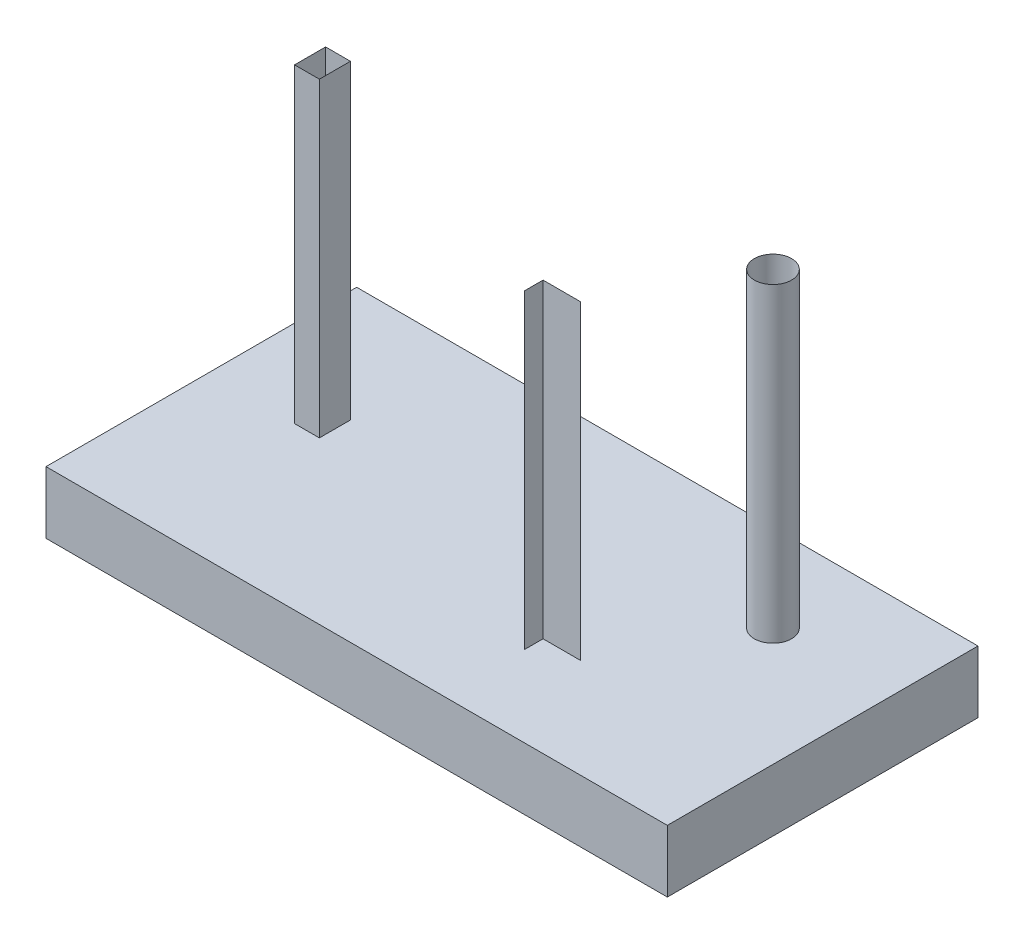
ISO-10303-21;
HEADER;
FILE_DESCRIPTION(('STEP AP214'),'2;1');
FILE_NAME('part.step','',(''),(''),'','','');
FILE_SCHEMA(('AUTOMOTIVE_DESIGN { 1 0 10303 214 1 1 1 1 }'));
ENDSEC;
DATA;
#1=APPLICATION_CONTEXT('core data for automotive mechanical design processes');
#2=APPLICATION_PROTOCOL_DEFINITION('international standard','automotive_design',2000,#1);
#3=PRODUCT_CONTEXT('',#1,'mechanical');
#4=PRODUCT('Part','Part','',(#3));
#5=PRODUCT_RELATED_PRODUCT_CATEGORY('part','',(#4));
#6=PRODUCT_DEFINITION_FORMATION('','',#4);
#7=PRODUCT_DEFINITION_CONTEXT('part definition',#1,'design');
#8=PRODUCT_DEFINITION('design','',#6,#7);
#9=PRODUCT_DEFINITION_SHAPE('','',#8);
#10=(LENGTH_UNIT() NAMED_UNIT(*) SI_UNIT(.MILLI.,.METRE.));
#11=(NAMED_UNIT(*) PLANE_ANGLE_UNIT() SI_UNIT($,.RADIAN.));
#12=(NAMED_UNIT(*) SI_UNIT($,.STERADIAN.) SOLID_ANGLE_UNIT());
#13=UNCERTAINTY_MEASURE_WITH_UNIT(LENGTH_MEASURE(1.E-05),#10,'distance_accuracy_value','');
#14=(GEOMETRIC_REPRESENTATION_CONTEXT(3) GLOBAL_UNCERTAINTY_ASSIGNED_CONTEXT((#13)) GLOBAL_UNIT_ASSIGNED_CONTEXT((#10,
#11,#12)) REPRESENTATION_CONTEXT('',''));
#15=CARTESIAN_POINT('',(0.,0.,0.));
#16=DIRECTION('',(0.,0.,1.));
#17=DIRECTION('',(1.,0.,0.));
#18=AXIS2_PLACEMENT_3D('',#15,#16,#17);
#19=CARTESIAN_POINT('',(71.,11.,-15.));
#20=DIRECTION('',(0.,0.,-1.));
#21=DIRECTION('',(-1.,0.,0.));
#22=AXIS2_PLACEMENT_3D('',#19,#20,#21);
#23=PLANE('',#22);
#24=DIRECTION('',(-1.,0.,0.));
#25=VECTOR('',#24,1.);
#26=CARTESIAN_POINT('',(71.,61.,-15.));
#27=LINE('',#26,#25);
#28=CARTESIAN_POINT('',(71.,61.,-15.));
#29=VERTEX_POINT('',#28);
#30=CARTESIAN_POINT('',(65.,61.,-15.));
#31=VERTEX_POINT('',#30);
#32=EDGE_CURVE('E94',#29,#31,#27,.T.);
#33=ORIENTED_EDGE('',*,*,#32,.F.);
#34=DIRECTION('',(0.,1.,0.));
#35=VECTOR('',#34,1.);
#36=CARTESIAN_POINT('',(71.,11.,-15.));
#37=LINE('',#36,#35);
#38=CARTESIAN_POINT('',(71.,11.,-15.));
#39=VERTEX_POINT('',#38);
#40=EDGE_CURVE('E63',#39,#29,#37,.T.);
#41=ORIENTED_EDGE('',*,*,#40,.F.);
#42=DIRECTION('',(-1.,0.,0.));
#43=VECTOR('',#42,1.);
#44=CARTESIAN_POINT('',(71.,11.,-15.));
#45=LINE('',#44,#43);
#46=CARTESIAN_POINT('',(65.,11.,-15.));
#47=VERTEX_POINT('',#46);
#48=EDGE_CURVE('E13',#39,#47,#45,.T.);
#49=ORIENTED_EDGE('',*,*,#48,.T.);
#50=DIRECTION('',(0.,1.,0.));
#51=VECTOR('',#50,1.);
#52=CARTESIAN_POINT('',(65.,11.,-15.));
#53=LINE('',#52,#51);
#54=EDGE_CURVE('E87',#47,#31,#53,.T.);
#55=ORIENTED_EDGE('',*,*,#54,.T.);
#56=EDGE_LOOP('',(#33,#41,#49,#55));
#57=FACE_BOUND('',#56,.T.);
#58=ADVANCED_FACE('F61',(#57),#23,.T.);
#59=CARTESIAN_POINT('',(65.,11.,-15.));
#60=DIRECTION('',(-1.,0.,0.));
#61=DIRECTION('',(0.,0.,1.));
#62=AXIS2_PLACEMENT_3D('',#59,#60,#61);
#63=PLANE('',#62);
#64=DIRECTION('',(0.,0.,1.));
#65=VECTOR('',#64,1.);
#66=CARTESIAN_POINT('',(65.,61.,-15.));
#67=LINE('',#66,#65);
#68=CARTESIAN_POINT('',(65.,61.,-12.));
#69=VERTEX_POINT('',#68);
#70=EDGE_CURVE('E111',#31,#69,#67,.T.);
#71=ORIENTED_EDGE('',*,*,#70,.F.);
#72=ORIENTED_EDGE('',*,*,#54,.F.);
#73=DIRECTION('',(0.,0.,1.));
#74=VECTOR('',#73,1.);
#75=CARTESIAN_POINT('',(65.,11.,-15.));
#76=LINE('',#75,#74);
#77=CARTESIAN_POINT('',(65.,11.,-12.));
#78=VERTEX_POINT('',#77);
#79=EDGE_CURVE('E106',#47,#78,#76,.T.);
#80=ORIENTED_EDGE('',*,*,#79,.T.);
#81=DIRECTION('',(0.,1.,0.));
#82=VECTOR('',#81,1.);
#83=CARTESIAN_POINT('',(65.,11.,-12.));
#84=LINE('',#83,#82);
#85=EDGE_CURVE('E74',#78,#69,#84,.T.);
#86=ORIENTED_EDGE('',*,*,#85,.T.);
#87=EDGE_LOOP('',(#71,#72,#80,#86));
#88=FACE_BOUND('',#87,.T.);
#89=ADVANCED_FACE('F122',(#88),#63,.T.);
#90=OPEN_SHELL('',(#58,#89));
#91=SHELL_BASED_SURFACE_MODEL('B2',(#90));
#92=CARTESIAN_POINT('',(19.,11.,-30.));
#93=DIRECTION('',(1.,0.,0.));
#94=DIRECTION('',(0.,0.,-1.));
#95=AXIS2_PLACEMENT_3D('',#92,#93,#94);
#96=PLANE('',#95);
#97=DIRECTION('',(0.,0.,-1.));
#98=VECTOR('',#97,1.);
#99=CARTESIAN_POINT('',(19.,61.,-30.));
#100=LINE('',#99,#98);
#101=CARTESIAN_POINT('',(19.,61.,-25.));
#102=VERTEX_POINT('',#101);
#103=CARTESIAN_POINT('',(19.,61.,-30.));
#104=VERTEX_POINT('',#103);
#105=EDGE_CURVE('E167',#102,#104,#100,.T.);
#106=ORIENTED_EDGE('',*,*,#105,.F.);
#107=DIRECTION('',(0.,1.,0.));
#108=VECTOR('',#107,1.);
#109=CARTESIAN_POINT('',(19.,11.,-25.));
#110=LINE('',#109,#108);
#111=CARTESIAN_POINT('',(19.,11.,-25.));
#112=VERTEX_POINT('',#111);
#113=EDGE_CURVE('E175',#112,#102,#110,.T.);
#114=ORIENTED_EDGE('',*,*,#113,.F.);
#115=DIRECTION('',(0.,0.,-1.));
#116=VECTOR('',#115,1.);
#117=CARTESIAN_POINT('',(19.,11.,-30.));
#118=LINE('',#117,#116);
#119=CARTESIAN_POINT('',(19.,11.,-30.));
#120=VERTEX_POINT('',#119);
#121=EDGE_CURVE('E59',#112,#120,#118,.T.);
#122=ORIENTED_EDGE('',*,*,#121,.T.);
#123=DIRECTION('',(0.,1.,0.));
#124=VECTOR('',#123,1.);
#125=CARTESIAN_POINT('',(19.,11.,-30.));
#126=LINE('',#125,#124);
#127=EDGE_CURVE('E161',#120,#104,#126,.T.);
#128=ORIENTED_EDGE('',*,*,#127,.T.);
#129=EDGE_LOOP('',(#106,#114,#122,#128));
#130=FACE_BOUND('',#129,.T.);
#131=ADVANCED_FACE('F159',(#130),#96,.T.);
#132=CARTESIAN_POINT('',(19.,11.,-30.));
#133=DIRECTION('',(0.,0.,-1.));
#134=DIRECTION('',(-1.,0.,0.));
#135=AXIS2_PLACEMENT_3D('',#132,#133,#134);
#136=PLANE('',#135);
#137=DIRECTION('',(-1.,0.,0.));
#138=VECTOR('',#137,1.);
#139=CARTESIAN_POINT('',(19.,61.,-30.));
#140=LINE('',#139,#138);
#141=CARTESIAN_POINT('',(15.,61.,-30.));
#142=VERTEX_POINT('',#141);
#143=EDGE_CURVE('E212',#104,#142,#140,.T.);
#144=ORIENTED_EDGE('',*,*,#143,.F.);
#145=ORIENTED_EDGE('',*,*,#127,.F.);
#146=DIRECTION('',(-1.,0.,0.));
#147=VECTOR('',#146,1.);
#148=CARTESIAN_POINT('',(19.,11.,-30.));
#149=LINE('',#148,#147);
#150=CARTESIAN_POINT('',(15.,11.,-30.));
#151=VERTEX_POINT('',#150);
#152=EDGE_CURVE('E214',#120,#151,#149,.T.);
#153=ORIENTED_EDGE('',*,*,#152,.T.);
#154=DIRECTION('',(0.,1.,0.));
#155=VECTOR('',#154,1.);
#156=CARTESIAN_POINT('',(15.,11.,-30.));
#157=LINE('',#156,#155);
#158=EDGE_CURVE('E204',#151,#142,#157,.T.);
#159=ORIENTED_EDGE('',*,*,#158,.T.);
#160=EDGE_LOOP('',(#144,#145,#153,#159));
#161=FACE_BOUND('',#160,.T.);
#162=ADVANCED_FACE('F215',(#161),#136,.T.);
#163=CARTESIAN_POINT('',(15.,11.,-30.));
#164=DIRECTION('',(-1.,0.,0.));
#165=DIRECTION('',(0.,0.,1.));
#166=AXIS2_PLACEMENT_3D('',#163,#164,#165);
#167=PLANE('',#166);
#168=DIRECTION('',(0.,0.,1.));
#169=VECTOR('',#168,1.);
#170=CARTESIAN_POINT('',(15.,61.,-30.));
#171=LINE('',#170,#169);
#172=CARTESIAN_POINT('',(15.,61.,-25.));
#173=VERTEX_POINT('',#172);
#174=EDGE_CURVE('E209',#142,#173,#171,.T.);
#175=ORIENTED_EDGE('',*,*,#174,.F.);
#176=ORIENTED_EDGE('',*,*,#158,.F.);
#177=DIRECTION('',(0.,0.,1.));
#178=VECTOR('',#177,1.);
#179=CARTESIAN_POINT('',(15.,11.,-30.));
#180=LINE('',#179,#178);
#181=CARTESIAN_POINT('',(15.,11.,-25.));
#182=VERTEX_POINT('',#181);
#183=EDGE_CURVE('E207',#151,#182,#180,.T.);
#184=ORIENTED_EDGE('',*,*,#183,.T.);
#185=DIRECTION('',(0.,1.,0.));
#186=VECTOR('',#185,1.);
#187=CARTESIAN_POINT('',(15.,11.,-25.));
#188=LINE('',#187,#186);
#189=EDGE_CURVE('E192',#182,#173,#188,.T.);
#190=ORIENTED_EDGE('',*,*,#189,.T.);
#191=EDGE_LOOP('',(#175,#176,#184,#190));
#192=FACE_BOUND('',#191,.T.);
#193=ADVANCED_FACE('F206',(#192),#167,.T.);
#194=CARTESIAN_POINT('',(19.,11.,-25.));
#195=DIRECTION('',(0.,0.,1.));
#196=DIRECTION('',(1.,0.,0.));
#197=AXIS2_PLACEMENT_3D('',#194,#195,#196);
#198=PLANE('',#197);
#199=DIRECTION('',(1.,0.,0.));
#200=VECTOR('',#199,1.);
#201=CARTESIAN_POINT('',(19.,61.,-25.));
#202=LINE('',#201,#200);
#203=EDGE_CURVE('E242',#173,#102,#202,.T.);
#204=ORIENTED_EDGE('',*,*,#203,.F.);
#205=ORIENTED_EDGE('',*,*,#189,.F.);
#206=DIRECTION('',(1.,0.,0.));
#207=VECTOR('',#206,1.);
#208=CARTESIAN_POINT('',(19.,11.,-25.));
#209=LINE('',#208,#207);
#210=EDGE_CURVE('E250',#182,#112,#209,.T.);
#211=ORIENTED_EDGE('',*,*,#210,.T.);
#212=ORIENTED_EDGE('',*,*,#113,.T.);
#213=EDGE_LOOP('',(#204,#205,#211,#212));
#214=FACE_BOUND('',#213,.T.);
#215=ADVANCED_FACE('F256',(#214),#198,.T.);
#216=OPEN_SHELL('',(#131,#162,#193,#215));
#217=SHELL_BASED_SURFACE_MODEL('B7',(#216));
#218=CARTESIAN_POINT('',(82.,11.,-35.));
#219=DIRECTION('',(0.,1.,0.));
#220=DIRECTION('',(0.,0.,1.));
#221=AXIS2_PLACEMENT_3D('',#218,#219,#220);
#222=CYLINDRICAL_SURFACE('',#221,3.00000000000001);
#223=CARTESIAN_POINT('',(82.,11.,-35.));
#224=DIRECTION('',(0.,1.,0.));
#225=DIRECTION('',(0.,0.,1.));
#226=AXIS2_PLACEMENT_3D('',#223,#224,#225);
#227=CIRCLE('',#226,3.00000000000001);
#228=CARTESIAN_POINT('',(82.,11.,-32.));
#229=VERTEX_POINT('',#228);
#230=EDGE_CURVE('E325',#229,#229,#227,.T.);
#231=ORIENTED_EDGE('',*,*,#230,.T.);
#232=EDGE_LOOP('',(#231));
#233=FACE_BOUND('',#232,.T.);
#234=CARTESIAN_POINT('',(82.,61.,-35.));
#235=DIRECTION('',(0.,1.,0.));
#236=DIRECTION('',(0.,0.,1.));
#237=AXIS2_PLACEMENT_3D('',#234,#235,#236);
#238=CIRCLE('',#237,3.00000000000001);
#239=CARTESIAN_POINT('',(82.,61.,-32.));
#240=VERTEX_POINT('',#239);
#241=EDGE_CURVE('E158',#240,#240,#238,.T.);
#242=ORIENTED_EDGE('',*,*,#241,.F.);
#243=EDGE_LOOP('',(#242));
#244=FACE_BOUND('',#243,.T.);
#245=ADVANCED_FACE('F320',(#233,#244),#222,.T.);
#246=OPEN_SHELL('',(#245));
#247=SHELL_BASED_SURFACE_MODEL('B53',(#246));
#248=CARTESIAN_POINT('',(0.,0.,-50.));
#249=DIRECTION('',(0.,-1.,0.));
#250=DIRECTION('',(0.,0.,-1.));
#251=AXIS2_PLACEMENT_3D('',#248,#249,#250);
#252=PLANE('',#251);
#253=DIRECTION('',(0.,0.,1.));
#254=VECTOR('',#253,1.);
#255=CARTESIAN_POINT('',(0.,0.,0.));
#256=LINE('',#255,#254);
#257=CARTESIAN_POINT('',(0.,0.,-50.));
#258=VERTEX_POINT('',#257);
#259=CARTESIAN_POINT('',(0.,0.,0.));
#260=VERTEX_POINT('',#259);
#261=EDGE_CURVE('E411',#258,#260,#256,.T.);
#262=ORIENTED_EDGE('',*,*,#261,.F.);
#263=DIRECTION('',(-1.,0.,0.));
#264=VECTOR('',#263,1.);
#265=CARTESIAN_POINT('',(0.,0.,-50.));
#266=LINE('',#265,#264);
#267=CARTESIAN_POINT('',(100.,0.,-50.));
#268=VERTEX_POINT('',#267);
#269=EDGE_CURVE('E433',#268,#258,#266,.T.);
#270=ORIENTED_EDGE('',*,*,#269,.F.);
#271=DIRECTION('',(0.,0.,-1.));
#272=VECTOR('',#271,1.);
#273=CARTESIAN_POINT('',(100.,0.,0.));
#274=LINE('',#273,#272);
#275=CARTESIAN_POINT('',(100.,0.,0.));
#276=VERTEX_POINT('',#275);
#277=EDGE_CURVE('E412',#276,#268,#274,.T.);
#278=ORIENTED_EDGE('',*,*,#277,.F.);
#279=DIRECTION('',(1.,0.,0.));
#280=VECTOR('',#279,1.);
#281=CARTESIAN_POINT('',(0.,0.,0.));
#282=LINE('',#281,#280);
#283=EDGE_CURVE('E406',#260,#276,#282,.T.);
#284=ORIENTED_EDGE('',*,*,#283,.F.);
#285=EDGE_LOOP('',(#262,#270,#278,#284));
#286=FACE_BOUND('',#285,.T.);
#287=DIRECTION('',(-1.,0.,0.));
#288=VECTOR('',#287,1.);
#289=CARTESIAN_POINT('',(0.,0.,-33.));
#290=LINE('',#289,#288);
#291=CARTESIAN_POINT('',(35.,0.,-33.));
#292=VERTEX_POINT('',#291);
#293=CARTESIAN_POINT('',(25.,0.,-33.));
#294=VERTEX_POINT('',#293);
#295=EDGE_CURVE('E366',#292,#294,#290,.T.);
#296=ORIENTED_EDGE('',*,*,#295,.T.);
#297=DIRECTION('',(0.,0.,1.));
#298=VECTOR('',#297,1.);
#299=CARTESIAN_POINT('',(25.,0.,-50.));
#300=LINE('',#299,#298);
#301=CARTESIAN_POINT('',(25.,0.,-25.));
#302=VERTEX_POINT('',#301);
#303=EDGE_CURVE('E318',#294,#302,#300,.T.);
#304=ORIENTED_EDGE('',*,*,#303,.T.);
#305=DIRECTION('',(1.,0.,0.));
#306=VECTOR('',#305,1.);
#307=CARTESIAN_POINT('',(0.,0.,-25.));
#308=LINE('',#307,#306);
#309=CARTESIAN_POINT('',(35.,0.,-25.));
#310=VERTEX_POINT('',#309);
#311=EDGE_CURVE('E424',#302,#310,#308,.T.);
#312=ORIENTED_EDGE('',*,*,#311,.T.);
#313=DIRECTION('',(0.,0.,-1.));
#314=VECTOR('',#313,1.);
#315=CARTESIAN_POINT('',(35.,0.,-50.));
#316=LINE('',#315,#314);
#317=EDGE_CURVE('E450',#310,#292,#316,.T.);
#318=ORIENTED_EDGE('',*,*,#317,.T.);
#319=EDGE_LOOP('',(#296,#304,#312,#318));
#320=FACE_BOUND('',#319,.T.);
#321=ADVANCED_FACE('F357',(#286,#320),#252,.T.);
#322=CARTESIAN_POINT('',(0.,10.,0.));
#323=DIRECTION('',(1.,0.,0.));
#324=DIRECTION('',(0.,0.,-1.));
#325=AXIS2_PLACEMENT_3D('',#322,#323,#324);
#326=PLANE('',#325);
#327=ORIENTED_EDGE('',*,*,#261,.T.);
#328=DIRECTION('',(0.,-1.,0.));
#329=VECTOR('',#328,1.);
#330=CARTESIAN_POINT('',(0.,10.,0.));
#331=LINE('',#330,#329);
#332=CARTESIAN_POINT('',(0.,10.,0.));
#333=VERTEX_POINT('',#332);
#334=EDGE_CURVE('E418',#333,#260,#331,.T.);
#335=ORIENTED_EDGE('',*,*,#334,.F.);
#336=DIRECTION('',(0.,0.,1.));
#337=VECTOR('',#336,1.);
#338=CARTESIAN_POINT('',(0.,10.,0.));
#339=LINE('',#338,#337);
#340=CARTESIAN_POINT('',(0.,10.,-50.));
#341=VERTEX_POINT('',#340);
#342=EDGE_CURVE('E435',#341,#333,#339,.T.);
#343=ORIENTED_EDGE('',*,*,#342,.F.);
#344=DIRECTION('',(0.,-1.,0.));
#345=VECTOR('',#344,1.);
#346=CARTESIAN_POINT('',(0.,10.,-50.));
#347=LINE('',#346,#345);
#348=EDGE_CURVE('E429',#341,#258,#347,.T.);
#349=ORIENTED_EDGE('',*,*,#348,.T.);
#350=EDGE_LOOP('',(#327,#335,#343,#349));
#351=FACE_BOUND('',#350,.T.);
#352=ADVANCED_FACE('F359',(#351),#326,.F.);
#353=CARTESIAN_POINT('',(0.,10.,0.));
#354=DIRECTION('',(0.,0.,-1.));
#355=DIRECTION('',(-1.,0.,0.));
#356=AXIS2_PLACEMENT_3D('',#353,#354,#355);
#357=PLANE('',#356);
#358=ORIENTED_EDGE('',*,*,#283,.T.);
#359=DIRECTION('',(0.,-1.,0.));
#360=VECTOR('',#359,1.);
#361=CARTESIAN_POINT('',(100.,10.,0.));
#362=LINE('',#361,#360);
#363=CARTESIAN_POINT('',(100.,10.,0.));
#364=VERTEX_POINT('',#363);
#365=EDGE_CURVE('E425',#364,#276,#362,.T.);
#366=ORIENTED_EDGE('',*,*,#365,.F.);
#367=DIRECTION('',(1.,0.,0.));
#368=VECTOR('',#367,1.);
#369=CARTESIAN_POINT('',(0.,10.,0.));
#370=LINE('',#369,#368);
#371=EDGE_CURVE('E420',#333,#364,#370,.T.);
#372=ORIENTED_EDGE('',*,*,#371,.F.);
#373=ORIENTED_EDGE('',*,*,#334,.T.);
#374=EDGE_LOOP('',(#358,#366,#372,#373));
#375=FACE_BOUND('',#374,.T.);
#376=ADVANCED_FACE('F419',(#375),#357,.F.);
#377=CARTESIAN_POINT('',(100.,10.,0.));
#378=DIRECTION('',(-1.,0.,0.));
#379=DIRECTION('',(0.,0.,1.));
#380=AXIS2_PLACEMENT_3D('',#377,#378,#379);
#381=PLANE('',#380);
#382=ORIENTED_EDGE('',*,*,#277,.T.);
#383=DIRECTION('',(0.,-1.,0.));
#384=VECTOR('',#383,1.);
#385=CARTESIAN_POINT('',(100.,10.,-50.));
#386=LINE('',#385,#384);
#387=CARTESIAN_POINT('',(100.,10.,-50.));
#388=VERTEX_POINT('',#387);
#389=EDGE_CURVE('E443',#388,#268,#386,.T.);
#390=ORIENTED_EDGE('',*,*,#389,.F.);
#391=DIRECTION('',(0.,0.,-1.));
#392=VECTOR('',#391,1.);
#393=CARTESIAN_POINT('',(100.,10.,0.));
#394=LINE('',#393,#392);
#395=EDGE_CURVE('E438',#364,#388,#394,.T.);
#396=ORIENTED_EDGE('',*,*,#395,.F.);
#397=ORIENTED_EDGE('',*,*,#365,.T.);
#398=EDGE_LOOP('',(#382,#390,#396,#397));
#399=FACE_BOUND('',#398,.T.);
#400=ADVANCED_FACE('F472',(#399),#381,.F.);
#401=CARTESIAN_POINT('',(0.,10.,-50.));
#402=DIRECTION('',(0.,0.,1.));
#403=DIRECTION('',(1.,0.,0.));
#404=AXIS2_PLACEMENT_3D('',#401,#402,#403);
#405=PLANE('',#404);
#406=ORIENTED_EDGE('',*,*,#269,.T.);
#407=ORIENTED_EDGE('',*,*,#348,.F.);
#408=DIRECTION('',(-1.,0.,0.));
#409=VECTOR('',#408,1.);
#410=CARTESIAN_POINT('',(0.,10.,-50.));
#411=LINE('',#410,#409);
#412=EDGE_CURVE('E440',#388,#341,#411,.T.);
#413=ORIENTED_EDGE('',*,*,#412,.F.);
#414=ORIENTED_EDGE('',*,*,#389,.T.);
#415=EDGE_LOOP('',(#406,#407,#413,#414));
#416=FACE_BOUND('',#415,.T.);
#417=ADVANCED_FACE('F462',(#416),#405,.F.);
#418=CARTESIAN_POINT('',(0.,10.,-50.));
#419=DIRECTION('',(0.,-1.,0.));
#420=DIRECTION('',(0.,0.,-1.));
#421=AXIS2_PLACEMENT_3D('',#418,#419,#420);
#422=PLANE('',#421);
#423=ORIENTED_EDGE('',*,*,#342,.T.);
#424=ORIENTED_EDGE('',*,*,#371,.T.);
#425=ORIENTED_EDGE('',*,*,#395,.T.);
#426=ORIENTED_EDGE('',*,*,#412,.T.);
#427=EDGE_LOOP('',(#423,#424,#425,#426));
#428=FACE_BOUND('',#427,.T.);
#429=ADVANCED_FACE('F457',(#428),#422,.F.);
#430=ORIENTED_EDGE('',*,*,#303,.F.);
#431=ORIENTED_EDGE('',*,*,#295,.F.);
#432=ORIENTED_EDGE('',*,*,#317,.F.);
#433=ORIENTED_EDGE('',*,*,#311,.F.);
#434=EDGE_LOOP('',(#430,#431,#432,#433));
#435=FACE_BOUND('',#434,.T.);
#436=ADVANCED_FACE('F455',(#435),#252,.T.);
#437=CLOSED_SHELL('',(#321,#352,#376,#400,#417,#429,#436));
#438=MANIFOLD_SOLID_BREP('B153',#437);
#439=ADVANCED_BREP_SHAPE_REPRESENTATION('',(#18,#438),#14);
#440=MANIFOLD_SURFACE_SHAPE_REPRESENTATION('',(#18,#91,#217,#247),#14);
#441=SHAPE_REPRESENTATION('',(#18),#14);
#442=SHAPE_DEFINITION_REPRESENTATION(#9,#441);
#443=SHAPE_REPRESENTATION_RELATIONSHIP('','',#441,#439);
#444=SHAPE_REPRESENTATION_RELATIONSHIP('','',#441,#440);
ENDSEC;
END-ISO-10303-21;
